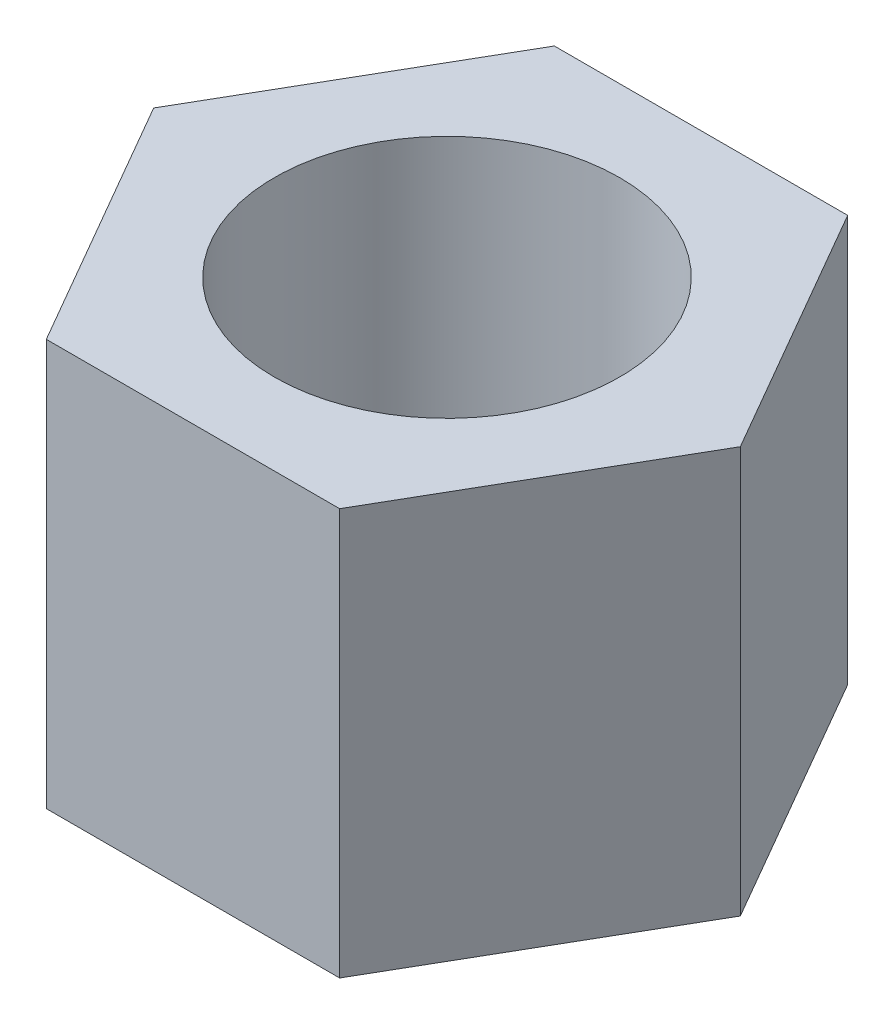
ISO-10303-21;
HEADER;
FILE_DESCRIPTION(('STEP AP214'),'2;1');
FILE_NAME('part.step','',(''),(''),'','','');
FILE_SCHEMA(('AUTOMOTIVE_DESIGN { 1 0 10303 214 1 1 1 1 }'));
ENDSEC;
DATA;
#1=APPLICATION_CONTEXT('core data for automotive mechanical design processes');
#2=APPLICATION_PROTOCOL_DEFINITION('international standard','automotive_design',2000,#1);
#3=PRODUCT_CONTEXT('',#1,'mechanical');
#4=PRODUCT('Part','Part','',(#3));
#5=PRODUCT_RELATED_PRODUCT_CATEGORY('part','',(#4));
#6=PRODUCT_DEFINITION_FORMATION('','',#4);
#7=PRODUCT_DEFINITION_CONTEXT('part definition',#1,'design');
#8=PRODUCT_DEFINITION('design','',#6,#7);
#9=PRODUCT_DEFINITION_SHAPE('','',#8);
#10=(LENGTH_UNIT() NAMED_UNIT(*) SI_UNIT(.MILLI.,.METRE.));
#11=(NAMED_UNIT(*) PLANE_ANGLE_UNIT() SI_UNIT($,.RADIAN.));
#12=(NAMED_UNIT(*) SI_UNIT($,.STERADIAN.) SOLID_ANGLE_UNIT());
#13=UNCERTAINTY_MEASURE_WITH_UNIT(LENGTH_MEASURE(1.E-05),#10,'distance_accuracy_value','');
#14=(GEOMETRIC_REPRESENTATION_CONTEXT(3) GLOBAL_UNCERTAINTY_ASSIGNED_CONTEXT((#13)) GLOBAL_UNIT_ASSIGNED_CONTEXT((#10,
#11,#12)) REPRESENTATION_CONTEXT('',''));
#15=CARTESIAN_POINT('',(0.,0.,0.));
#16=DIRECTION('',(0.,0.,1.));
#17=DIRECTION('',(1.,0.,0.));
#18=AXIS2_PLACEMENT_3D('',#15,#16,#17);
#19=CARTESIAN_POINT('',(0.,2.,0.));
#20=DIRECTION('',(0.,1.,0.));
#21=DIRECTION('',(0.,0.,1.));
#22=AXIS2_PLACEMENT_3D('',#19,#20,#21);
#23=PLANE('',#22);
#24=DIRECTION('',(-0.5,0.,0.866025403784439));
#25=VECTOR('',#24,1.);
#26=CARTESIAN_POINT('',(-1.44337567297406,2.,-2.5));
#27=LINE('',#26,#25);
#28=CARTESIAN_POINT('',(-1.44337567297406,2.,-2.5));
#29=VERTEX_POINT('',#28);
#30=CARTESIAN_POINT('',(-2.88675134594813,2.,0.));
#31=VERTEX_POINT('',#30);
#32=EDGE_CURVE('E129',#29,#31,#27,.T.);
#33=ORIENTED_EDGE('',*,*,#32,.T.);
#34=DIRECTION('',(0.5,0.,0.866025403784439));
#35=VECTOR('',#34,1.);
#36=CARTESIAN_POINT('',(-2.88675134594813,2.,0.));
#37=LINE('',#36,#35);
#38=CARTESIAN_POINT('',(-1.44337567297406,2.,2.5));
#39=VERTEX_POINT('',#38);
#40=EDGE_CURVE('E87',#31,#39,#37,.T.);
#41=ORIENTED_EDGE('',*,*,#40,.T.);
#42=DIRECTION('',(1.,0.,0.));
#43=VECTOR('',#42,1.);
#44=CARTESIAN_POINT('',(-1.44337567297406,2.,2.5));
#45=LINE('',#44,#43);
#46=CARTESIAN_POINT('',(1.44337567297406,2.,2.5));
#47=VERTEX_POINT('',#46);
#48=EDGE_CURVE('E100',#39,#47,#45,.T.);
#49=ORIENTED_EDGE('',*,*,#48,.T.);
#50=DIRECTION('',(0.5,0.,-0.866025403784439));
#51=VECTOR('',#50,1.);
#52=CARTESIAN_POINT('',(1.44337567297406,2.,2.5));
#53=LINE('',#52,#51);
#54=CARTESIAN_POINT('',(2.88675134594813,2.,0.));
#55=VERTEX_POINT('',#54);
#56=EDGE_CURVE('E94',#47,#55,#53,.T.);
#57=ORIENTED_EDGE('',*,*,#56,.T.);
#58=DIRECTION('',(-0.5,0.,-0.866025403784439));
#59=VECTOR('',#58,1.);
#60=CARTESIAN_POINT('',(2.88675134594813,2.,0.));
#61=LINE('',#60,#59);
#62=CARTESIAN_POINT('',(1.44337567297407,2.,-2.5));
#63=VERTEX_POINT('',#62);
#64=EDGE_CURVE('E98',#55,#63,#61,.T.);
#65=ORIENTED_EDGE('',*,*,#64,.T.);
#66=DIRECTION('',(-1.,0.,0.));
#67=VECTOR('',#66,1.);
#68=CARTESIAN_POINT('',(1.44337567297407,2.,-2.5));
#69=LINE('',#68,#67);
#70=EDGE_CURVE('E50',#63,#29,#69,.T.);
#71=ORIENTED_EDGE('',*,*,#70,.T.);
#72=EDGE_LOOP('',(#33,#41,#49,#57,#65,#71));
#73=FACE_BOUND('',#72,.T.);
#74=CARTESIAN_POINT('',(0.,2.,0.));
#75=DIRECTION('',(0.,1.,0.));
#76=DIRECTION('',(0.,0.,1.));
#77=AXIS2_PLACEMENT_3D('',#74,#75,#76);
#78=CIRCLE('',#77,1.7);
#79=CARTESIAN_POINT('',(0.,2.,1.7));
#80=VERTEX_POINT('',#79);
#81=EDGE_CURVE('E122',#80,#80,#78,.T.);
#82=ORIENTED_EDGE('',*,*,#81,.F.);
#83=EDGE_LOOP('',(#82));
#84=FACE_BOUND('',#83,.T.);
#85=ADVANCED_FACE('F33',(#73,#84),#23,.T.);
#86=CARTESIAN_POINT('',(0.,-2.,0.));
#87=DIRECTION('',(0.,1.,0.));
#88=DIRECTION('',(0.,0.,1.));
#89=AXIS2_PLACEMENT_3D('',#86,#87,#88);
#90=PLANE('',#89);
#91=DIRECTION('',(-0.5,0.,0.866025403784439));
#92=VECTOR('',#91,1.);
#93=CARTESIAN_POINT('',(-1.44337567297406,-2.,-2.5));
#94=LINE('',#93,#92);
#95=CARTESIAN_POINT('',(-1.44337567297406,-2.,-2.5));
#96=VERTEX_POINT('',#95);
#97=CARTESIAN_POINT('',(-2.88675134594813,-2.,0.));
#98=VERTEX_POINT('',#97);
#99=EDGE_CURVE('E118',#96,#98,#94,.T.);
#100=ORIENTED_EDGE('',*,*,#99,.F.);
#101=DIRECTION('',(-1.,0.,0.));
#102=VECTOR('',#101,1.);
#103=CARTESIAN_POINT('',(1.44337567297407,-2.,-2.5));
#104=LINE('',#103,#102);
#105=CARTESIAN_POINT('',(1.44337567297407,-2.,-2.5));
#106=VERTEX_POINT('',#105);
#107=EDGE_CURVE('E79',#106,#96,#104,.T.);
#108=ORIENTED_EDGE('',*,*,#107,.F.);
#109=DIRECTION('',(-0.5,0.,-0.866025403784439));
#110=VECTOR('',#109,1.);
#111=CARTESIAN_POINT('',(2.88675134594813,-2.,0.));
#112=LINE('',#111,#110);
#113=CARTESIAN_POINT('',(2.88675134594813,-2.,0.));
#114=VERTEX_POINT('',#113);
#115=EDGE_CURVE('E73',#114,#106,#112,.T.);
#116=ORIENTED_EDGE('',*,*,#115,.F.);
#117=DIRECTION('',(0.5,0.,-0.866025403784439));
#118=VECTOR('',#117,1.);
#119=CARTESIAN_POINT('',(1.44337567297406,-2.,2.5));
#120=LINE('',#119,#118);
#121=CARTESIAN_POINT('',(1.44337567297406,-2.,2.5));
#122=VERTEX_POINT('',#121);
#123=EDGE_CURVE('E108',#122,#114,#120,.T.);
#124=ORIENTED_EDGE('',*,*,#123,.F.);
#125=DIRECTION('',(1.,0.,0.));
#126=VECTOR('',#125,1.);
#127=CARTESIAN_POINT('',(-1.44337567297406,-2.,2.5));
#128=LINE('',#127,#126);
#129=CARTESIAN_POINT('',(-1.44337567297406,-2.,2.5));
#130=VERTEX_POINT('',#129);
#131=EDGE_CURVE('E124',#130,#122,#128,.T.);
#132=ORIENTED_EDGE('',*,*,#131,.F.);
#133=DIRECTION('',(0.5,0.,0.866025403784439));
#134=VECTOR('',#133,1.);
#135=CARTESIAN_POINT('',(-2.88675134594813,-2.,0.));
#136=LINE('',#135,#134);
#137=EDGE_CURVE('E121',#98,#130,#136,.T.);
#138=ORIENTED_EDGE('',*,*,#137,.F.);
#139=EDGE_LOOP('',(#100,#108,#116,#124,#132,#138));
#140=FACE_BOUND('',#139,.T.);
#141=CARTESIAN_POINT('',(0.,-2.,0.));
#142=DIRECTION('',(0.,1.,0.));
#143=DIRECTION('',(0.,0.,1.));
#144=AXIS2_PLACEMENT_3D('',#141,#142,#143);
#145=CIRCLE('',#144,1.7);
#146=CARTESIAN_POINT('',(0.,-2.,1.7));
#147=VERTEX_POINT('',#146);
#148=EDGE_CURVE('E222',#147,#147,#145,.T.);
#149=ORIENTED_EDGE('',*,*,#148,.T.);
#150=EDGE_LOOP('',(#149));
#151=FACE_BOUND('',#150,.T.);
#152=ADVANCED_FACE('F138',(#140,#151),#90,.F.);
#153=CARTESIAN_POINT('',(-1.44337567297406,2.,-2.5));
#154=DIRECTION('',(0.866025403784439,0.,0.5));
#155=DIRECTION('',(0.5,0.,-0.866025403784439));
#156=AXIS2_PLACEMENT_3D('',#153,#154,#155);
#157=PLANE('',#156);
#158=ORIENTED_EDGE('',*,*,#99,.T.);
#159=DIRECTION('',(0.,-1.,0.));
#160=VECTOR('',#159,1.);
#161=CARTESIAN_POINT('',(-2.88675134594813,2.,0.));
#162=LINE('',#161,#160);
#163=EDGE_CURVE('E11',#31,#98,#162,.T.);
#164=ORIENTED_EDGE('',*,*,#163,.F.);
#165=ORIENTED_EDGE('',*,*,#32,.F.);
#166=DIRECTION('',(0.,-1.,0.));
#167=VECTOR('',#166,1.);
#168=CARTESIAN_POINT('',(-1.44337567297406,2.,-2.5));
#169=LINE('',#168,#167);
#170=EDGE_CURVE('E114',#29,#96,#169,.T.);
#171=ORIENTED_EDGE('',*,*,#170,.T.);
#172=EDGE_LOOP('',(#158,#164,#165,#171));
#173=FACE_BOUND('',#172,.T.);
#174=ADVANCED_FACE('F35',(#173),#157,.F.);
#175=CARTESIAN_POINT('',(-2.88675134594813,2.,0.));
#176=DIRECTION('',(0.866025403784439,0.,-0.5));
#177=DIRECTION('',(-0.5,0.,-0.866025403784439));
#178=AXIS2_PLACEMENT_3D('',#175,#176,#177);
#179=PLANE('',#178);
#180=ORIENTED_EDGE('',*,*,#137,.T.);
#181=DIRECTION('',(0.,-1.,0.));
#182=VECTOR('',#181,1.);
#183=CARTESIAN_POINT('',(-1.44337567297406,2.,2.5));
#184=LINE('',#183,#182);
#185=EDGE_CURVE('E42',#39,#130,#184,.T.);
#186=ORIENTED_EDGE('',*,*,#185,.F.);
#187=ORIENTED_EDGE('',*,*,#40,.F.);
#188=ORIENTED_EDGE('',*,*,#163,.T.);
#189=EDGE_LOOP('',(#180,#186,#187,#188));
#190=FACE_BOUND('',#189,.T.);
#191=ADVANCED_FACE('F163',(#190),#179,.F.);
#192=CARTESIAN_POINT('',(-1.44337567297406,2.,2.5));
#193=DIRECTION('',(0.,0.,-1.));
#194=DIRECTION('',(-1.,0.,0.));
#195=AXIS2_PLACEMENT_3D('',#192,#193,#194);
#196=PLANE('',#195);
#197=ORIENTED_EDGE('',*,*,#131,.T.);
#198=DIRECTION('',(0.,-1.,0.));
#199=VECTOR('',#198,1.);
#200=CARTESIAN_POINT('',(1.44337567297406,2.,2.5));
#201=LINE('',#200,#199);
#202=EDGE_CURVE('E109',#47,#122,#201,.T.);
#203=ORIENTED_EDGE('',*,*,#202,.F.);
#204=ORIENTED_EDGE('',*,*,#48,.F.);
#205=ORIENTED_EDGE('',*,*,#185,.T.);
#206=EDGE_LOOP('',(#197,#203,#204,#205));
#207=FACE_BOUND('',#206,.T.);
#208=ADVANCED_FACE('F135',(#207),#196,.F.);
#209=CARTESIAN_POINT('',(1.44337567297406,2.,2.5));
#210=DIRECTION('',(-0.866025403784439,0.,-0.5));
#211=DIRECTION('',(-0.5,0.,0.866025403784439));
#212=AXIS2_PLACEMENT_3D('',#209,#210,#211);
#213=PLANE('',#212);
#214=ORIENTED_EDGE('',*,*,#123,.T.);
#215=DIRECTION('',(0.,-1.,0.));
#216=VECTOR('',#215,1.);
#217=CARTESIAN_POINT('',(2.88675134594813,2.,0.));
#218=LINE('',#217,#216);
#219=EDGE_CURVE('E105',#55,#114,#218,.T.);
#220=ORIENTED_EDGE('',*,*,#219,.F.);
#221=ORIENTED_EDGE('',*,*,#56,.F.);
#222=ORIENTED_EDGE('',*,*,#202,.T.);
#223=EDGE_LOOP('',(#214,#220,#221,#222));
#224=FACE_BOUND('',#223,.T.);
#225=ADVANCED_FACE('F106',(#224),#213,.F.);
#226=CARTESIAN_POINT('',(2.88675134594813,2.,0.));
#227=DIRECTION('',(-0.866025403784439,0.,0.5));
#228=DIRECTION('',(0.5,0.,0.866025403784439));
#229=AXIS2_PLACEMENT_3D('',#226,#227,#228);
#230=PLANE('',#229);
#231=ORIENTED_EDGE('',*,*,#115,.T.);
#232=DIRECTION('',(0.,-1.,0.));
#233=VECTOR('',#232,1.);
#234=CARTESIAN_POINT('',(1.44337567297407,2.,-2.5));
#235=LINE('',#234,#233);
#236=EDGE_CURVE('E110',#63,#106,#235,.T.);
#237=ORIENTED_EDGE('',*,*,#236,.F.);
#238=ORIENTED_EDGE('',*,*,#64,.F.);
#239=ORIENTED_EDGE('',*,*,#219,.T.);
#240=EDGE_LOOP('',(#231,#237,#238,#239));
#241=FACE_BOUND('',#240,.T.);
#242=ADVANCED_FACE('F112',(#241),#230,.F.);
#243=CARTESIAN_POINT('',(1.44337567297407,2.,-2.5));
#244=DIRECTION('',(0.,0.,1.));
#245=DIRECTION('',(1.,0.,0.));
#246=AXIS2_PLACEMENT_3D('',#243,#244,#245);
#247=PLANE('',#246);
#248=ORIENTED_EDGE('',*,*,#107,.T.);
#249=ORIENTED_EDGE('',*,*,#170,.F.);
#250=ORIENTED_EDGE('',*,*,#70,.F.);
#251=ORIENTED_EDGE('',*,*,#236,.T.);
#252=EDGE_LOOP('',(#248,#249,#250,#251));
#253=FACE_BOUND('',#252,.T.);
#254=ADVANCED_FACE('F143',(#253),#247,.F.);
#255=CARTESIAN_POINT('',(0.,2.,0.));
#256=DIRECTION('',(0.,-1.,0.));
#257=DIRECTION('',(0.,0.,-1.));
#258=AXIS2_PLACEMENT_3D('',#255,#256,#257);
#259=CYLINDRICAL_SURFACE('',#258,1.7);
#260=ORIENTED_EDGE('',*,*,#81,.T.);
#261=EDGE_LOOP('',(#260));
#262=FACE_BOUND('',#261,.T.);
#263=ORIENTED_EDGE('',*,*,#148,.F.);
#264=EDGE_LOOP('',(#263));
#265=FACE_BOUND('',#264,.T.);
#266=ADVANCED_FACE('F145',(#262,#265),#259,.F.);
#267=CLOSED_SHELL('',(#85,#152,#174,#191,#208,#225,#242,#254,#266));
#268=MANIFOLD_SOLID_BREP('B2',#267);
#269=ADVANCED_BREP_SHAPE_REPRESENTATION('',(#18,#268),#14);
#270=SHAPE_DEFINITION_REPRESENTATION(#9,#269);
ENDSEC;
END-ISO-10303-21;
